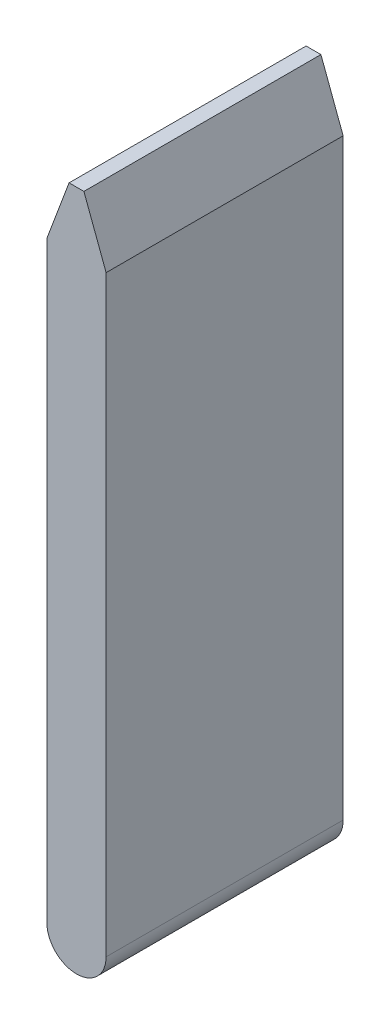
ISO-10303-21;
HEADER;
FILE_DESCRIPTION(('STEP AP214'),'2;1');
FILE_NAME('part.step','',(''),(''),'','','');
FILE_SCHEMA(('AUTOMOTIVE_DESIGN { 1 0 10303 214 1 1 1 1 }'));
ENDSEC;
DATA;
#1=APPLICATION_CONTEXT('core data for automotive mechanical design processes');
#2=APPLICATION_PROTOCOL_DEFINITION('international standard','automotive_design',2000,#1);
#3=PRODUCT_CONTEXT('',#1,'mechanical');
#4=PRODUCT('Part','Part','',(#3));
#5=PRODUCT_RELATED_PRODUCT_CATEGORY('part','',(#4));
#6=PRODUCT_DEFINITION_FORMATION('','',#4);
#7=PRODUCT_DEFINITION_CONTEXT('part definition',#1,'design');
#8=PRODUCT_DEFINITION('design','',#6,#7);
#9=PRODUCT_DEFINITION_SHAPE('','',#8);
#10=(LENGTH_UNIT() NAMED_UNIT(*) SI_UNIT(.MILLI.,.METRE.));
#11=(NAMED_UNIT(*) PLANE_ANGLE_UNIT() SI_UNIT($,.RADIAN.));
#12=(NAMED_UNIT(*) SI_UNIT($,.STERADIAN.) SOLID_ANGLE_UNIT());
#13=UNCERTAINTY_MEASURE_WITH_UNIT(LENGTH_MEASURE(1.E-05),#10,'distance_accuracy_value','');
#14=(GEOMETRIC_REPRESENTATION_CONTEXT(3) GLOBAL_UNCERTAINTY_ASSIGNED_CONTEXT((#13)) GLOBAL_UNIT_ASSIGNED_CONTEXT((#10,
#11,#12)) REPRESENTATION_CONTEXT('',''));
#15=CARTESIAN_POINT('',(0.,0.,0.));
#16=DIRECTION('',(0.,0.,1.));
#17=DIRECTION('',(1.,0.,0.));
#18=AXIS2_PLACEMENT_3D('',#15,#16,#17);
#19=CARTESIAN_POINT('',(-10.,0.,80.));
#20=DIRECTION('',(-1.,0.,0.));
#21=DIRECTION('',(0.,-1.,0.));
#22=AXIS2_PLACEMENT_3D('',#19,#20,#21);
#23=PLANE('',#22);
#24=DIRECTION('',(0.,1.,0.));
#25=VECTOR('',#24,1.);
#26=CARTESIAN_POINT('',(-10.,0.,0.));
#27=LINE('',#26,#25);
#28=CARTESIAN_POINT('',(-10.,0.,0.));
#29=VERTEX_POINT('',#28);
#30=CARTESIAN_POINT('',(-10.,200.,0.));
#31=VERTEX_POINT('',#30);
#32=EDGE_CURVE('E121',#29,#31,#27,.T.);
#33=ORIENTED_EDGE('',*,*,#32,.F.);
#34=DIRECTION('',(0.,0.,-1.));
#35=VECTOR('',#34,1.);
#36=CARTESIAN_POINT('',(-10.,0.,80.));
#37=LINE('',#36,#35);
#38=CARTESIAN_POINT('',(-10.,0.,80.));
#39=VERTEX_POINT('',#38);
#40=EDGE_CURVE('E11',#39,#29,#37,.T.);
#41=ORIENTED_EDGE('',*,*,#40,.F.);
#42=DIRECTION('',(0.,1.,0.));
#43=VECTOR('',#42,1.);
#44=CARTESIAN_POINT('',(-10.,0.,80.));
#45=LINE('',#44,#43);
#46=CARTESIAN_POINT('',(-10.,200.,80.));
#47=VERTEX_POINT('',#46);
#48=EDGE_CURVE('E135',#39,#47,#45,.T.);
#49=ORIENTED_EDGE('',*,*,#48,.T.);
#50=DIRECTION('',(0.,0.,-1.));
#51=VECTOR('',#50,1.);
#52=CARTESIAN_POINT('',(-10.,200.,80.));
#53=LINE('',#52,#51);
#54=EDGE_CURVE('E56',#47,#31,#53,.T.);
#55=ORIENTED_EDGE('',*,*,#54,.T.);
#56=EDGE_LOOP('',(#33,#41,#49,#55));
#57=FACE_BOUND('',#56,.T.);
#58=ADVANCED_FACE('F40',(#57),#23,.T.);
#59=CARTESIAN_POINT('',(0.,0.,80.));
#60=DIRECTION('',(0.,0.,-1.));
#61=DIRECTION('',(-1.,0.,0.));
#62=AXIS2_PLACEMENT_3D('',#59,#60,#61);
#63=CYLINDRICAL_SURFACE('',#62,10.);
#64=CARTESIAN_POINT('',(0.,0.,0.));
#65=DIRECTION('',(0.,0.,1.));
#66=DIRECTION('',(1.,0.,0.));
#67=AXIS2_PLACEMENT_3D('',#64,#65,#66);
#68=CIRCLE('',#67,10.);
#69=CARTESIAN_POINT('',(10.,0.,0.));
#70=VERTEX_POINT('',#69);
#71=EDGE_CURVE('E123',#29,#70,#68,.T.);
#72=ORIENTED_EDGE('',*,*,#71,.T.);
#73=DIRECTION('',(0.,0.,-1.));
#74=VECTOR('',#73,1.);
#75=CARTESIAN_POINT('',(10.,0.,80.));
#76=LINE('',#75,#74);
#77=CARTESIAN_POINT('',(10.,0.,80.));
#78=VERTEX_POINT('',#77);
#79=EDGE_CURVE('E48',#78,#70,#76,.T.);
#80=ORIENTED_EDGE('',*,*,#79,.F.);
#81=CARTESIAN_POINT('',(0.,0.,80.));
#82=DIRECTION('',(0.,0.,1.));
#83=DIRECTION('',(1.,0.,0.));
#84=AXIS2_PLACEMENT_3D('',#81,#82,#83);
#85=CIRCLE('',#84,10.);
#86=EDGE_CURVE('E224',#39,#78,#85,.T.);
#87=ORIENTED_EDGE('',*,*,#86,.F.);
#88=ORIENTED_EDGE('',*,*,#40,.T.);
#89=EDGE_LOOP('',(#72,#80,#87,#88));
#90=FACE_BOUND('',#89,.T.);
#91=ADVANCED_FACE('F144',(#90),#63,.T.);
#92=CARTESIAN_POINT('',(10.,0.,80.));
#93=DIRECTION('',(1.,0.,0.));
#94=DIRECTION('',(0.,1.,0.));
#95=AXIS2_PLACEMENT_3D('',#92,#93,#94);
#96=PLANE('',#95);
#97=DIRECTION('',(0.,-1.,0.));
#98=VECTOR('',#97,1.);
#99=CARTESIAN_POINT('',(10.,0.,0.));
#100=LINE('',#99,#98);
#101=CARTESIAN_POINT('',(10.,200.,0.));
#102=VERTEX_POINT('',#101);
#103=EDGE_CURVE('E126',#102,#70,#100,.T.);
#104=ORIENTED_EDGE('',*,*,#103,.F.);
#105=DIRECTION('',(0.,0.,-1.));
#106=VECTOR('',#105,1.);
#107=CARTESIAN_POINT('',(10.,200.,80.));
#108=LINE('',#107,#106);
#109=CARTESIAN_POINT('',(10.,200.,80.));
#110=VERTEX_POINT('',#109);
#111=EDGE_CURVE('E103',#110,#102,#108,.T.);
#112=ORIENTED_EDGE('',*,*,#111,.F.);
#113=DIRECTION('',(0.,-1.,0.));
#114=VECTOR('',#113,1.);
#115=CARTESIAN_POINT('',(10.,0.,80.));
#116=LINE('',#115,#114);
#117=EDGE_CURVE('E113',#110,#78,#116,.T.);
#118=ORIENTED_EDGE('',*,*,#117,.T.);
#119=ORIENTED_EDGE('',*,*,#79,.T.);
#120=EDGE_LOOP('',(#104,#112,#118,#119));
#121=FACE_BOUND('',#120,.T.);
#122=ADVANCED_FACE('F141',(#121),#96,.T.);
#123=CARTESIAN_POINT('',(74.5205479452055,27.9452054794521,80.));
#124=DIRECTION('',(0.936329177569045,0.351123441588392,0.));
#125=DIRECTION('',(-0.351123441588392,0.936329177569045,0.));
#126=AXIS2_PLACEMENT_3D('',#123,#124,#125);
#127=PLANE('',#126);
#128=DIRECTION('',(0.351123441588392,-0.936329177569045,0.));
#129=VECTOR('',#128,1.);
#130=CARTESIAN_POINT('',(74.5205479452055,27.9452054794521,0.));
#131=LINE('',#130,#129);
#132=CARTESIAN_POINT('',(2.5,220.,0.));
#133=VERTEX_POINT('',#132);
#134=EDGE_CURVE('E99',#133,#102,#131,.T.);
#135=ORIENTED_EDGE('',*,*,#134,.F.);
#136=DIRECTION('',(0.,0.,-1.));
#137=VECTOR('',#136,1.);
#138=CARTESIAN_POINT('',(2.5,220.,80.));
#139=LINE('',#138,#137);
#140=CARTESIAN_POINT('',(2.5,220.,80.));
#141=VERTEX_POINT('',#140);
#142=EDGE_CURVE('E94',#141,#133,#139,.T.);
#143=ORIENTED_EDGE('',*,*,#142,.F.);
#144=DIRECTION('',(0.351123441588392,-0.936329177569045,0.));
#145=VECTOR('',#144,1.);
#146=CARTESIAN_POINT('',(74.5205479452055,27.9452054794521,80.));
#147=LINE('',#146,#145);
#148=EDGE_CURVE('E97',#141,#110,#147,.T.);
#149=ORIENTED_EDGE('',*,*,#148,.T.);
#150=ORIENTED_EDGE('',*,*,#111,.T.);
#151=EDGE_LOOP('',(#135,#143,#149,#150));
#152=FACE_BOUND('',#151,.T.);
#153=ADVANCED_FACE('F96',(#152),#127,.T.);
#154=CARTESIAN_POINT('',(0.,220.,80.));
#155=DIRECTION('',(0.,1.,0.));
#156=DIRECTION('',(0.,0.,1.));
#157=AXIS2_PLACEMENT_3D('',#154,#155,#156);
#158=PLANE('',#157);
#159=DIRECTION('',(1.,0.,0.));
#160=VECTOR('',#159,1.);
#161=CARTESIAN_POINT('',(0.,220.,0.));
#162=LINE('',#161,#160);
#163=CARTESIAN_POINT('',(-2.49999999999999,220.,0.));
#164=VERTEX_POINT('',#163);
#165=EDGE_CURVE('E130',#164,#133,#162,.T.);
#166=ORIENTED_EDGE('',*,*,#165,.F.);
#167=DIRECTION('',(0.,0.,-1.));
#168=VECTOR('',#167,1.);
#169=CARTESIAN_POINT('',(-2.49999999999999,220.,80.));
#170=LINE('',#169,#168);
#171=CARTESIAN_POINT('',(-2.49999999999999,220.,80.));
#172=VERTEX_POINT('',#171);
#173=EDGE_CURVE('E75',#172,#164,#170,.T.);
#174=ORIENTED_EDGE('',*,*,#173,.F.);
#175=DIRECTION('',(1.,0.,0.));
#176=VECTOR('',#175,1.);
#177=CARTESIAN_POINT('',(0.,220.,80.));
#178=LINE('',#177,#176);
#179=EDGE_CURVE('E111',#172,#141,#178,.T.);
#180=ORIENTED_EDGE('',*,*,#179,.T.);
#181=ORIENTED_EDGE('',*,*,#142,.T.);
#182=EDGE_LOOP('',(#166,#174,#180,#181));
#183=FACE_BOUND('',#182,.T.);
#184=ADVANCED_FACE('F115',(#183),#158,.T.);
#185=CARTESIAN_POINT('',(-74.5205479452055,27.9452054794521,80.));
#186=DIRECTION('',(-0.936329177569045,0.351123441588392,0.));
#187=DIRECTION('',(-0.351123441588392,-0.936329177569045,0.));
#188=AXIS2_PLACEMENT_3D('',#185,#186,#187);
#189=PLANE('',#188);
#190=DIRECTION('',(0.351123441588392,0.936329177569045,0.));
#191=VECTOR('',#190,1.);
#192=CARTESIAN_POINT('',(-74.5205479452055,27.9452054794521,0.));
#193=LINE('',#192,#191);
#194=EDGE_CURVE('E132',#31,#164,#193,.T.);
#195=ORIENTED_EDGE('',*,*,#194,.F.);
#196=ORIENTED_EDGE('',*,*,#54,.F.);
#197=DIRECTION('',(0.351123441588392,0.936329177569045,0.));
#198=VECTOR('',#197,1.);
#199=CARTESIAN_POINT('',(-74.5205479452055,27.9452054794521,80.));
#200=LINE('',#199,#198);
#201=EDGE_CURVE('E116',#47,#172,#200,.T.);
#202=ORIENTED_EDGE('',*,*,#201,.T.);
#203=ORIENTED_EDGE('',*,*,#173,.T.);
#204=EDGE_LOOP('',(#195,#196,#202,#203));
#205=FACE_BOUND('',#204,.T.);
#206=ADVANCED_FACE('F147',(#205),#189,.T.);
#207=CARTESIAN_POINT('',(0.,0.,80.));
#208=DIRECTION('',(0.,0.,1.));
#209=DIRECTION('',(1.,0.,0.));
#210=AXIS2_PLACEMENT_3D('',#207,#208,#209);
#211=PLANE('',#210);
#212=ORIENTED_EDGE('',*,*,#48,.F.);
#213=ORIENTED_EDGE('',*,*,#86,.T.);
#214=ORIENTED_EDGE('',*,*,#117,.F.);
#215=ORIENTED_EDGE('',*,*,#148,.F.);
#216=ORIENTED_EDGE('',*,*,#179,.F.);
#217=ORIENTED_EDGE('',*,*,#201,.F.);
#218=EDGE_LOOP('',(#212,#213,#214,#215,#216,#217));
#219=FACE_BOUND('',#218,.T.);
#220=ADVANCED_FACE('F109',(#219),#211,.T.);
#221=CARTESIAN_POINT('',(0.,0.,0.));
#222=DIRECTION('',(0.,0.,1.));
#223=DIRECTION('',(1.,0.,0.));
#224=AXIS2_PLACEMENT_3D('',#221,#222,#223);
#225=PLANE('',#224);
#226=ORIENTED_EDGE('',*,*,#32,.T.);
#227=ORIENTED_EDGE('',*,*,#194,.T.);
#228=ORIENTED_EDGE('',*,*,#165,.T.);
#229=ORIENTED_EDGE('',*,*,#134,.T.);
#230=ORIENTED_EDGE('',*,*,#103,.T.);
#231=ORIENTED_EDGE('',*,*,#71,.F.);
#232=EDGE_LOOP('',(#226,#227,#228,#229,#230,#231));
#233=FACE_BOUND('',#232,.T.);
#234=ADVANCED_FACE('F146',(#233),#225,.F.);
#235=CLOSED_SHELL('',(#58,#91,#122,#153,#184,#206,#220,#234));
#236=MANIFOLD_SOLID_BREP('B2',#235);
#237=ADVANCED_BREP_SHAPE_REPRESENTATION('',(#18,#236),#14);
#238=SHAPE_DEFINITION_REPRESENTATION(#9,#237);
ENDSEC;
END-ISO-10303-21;
